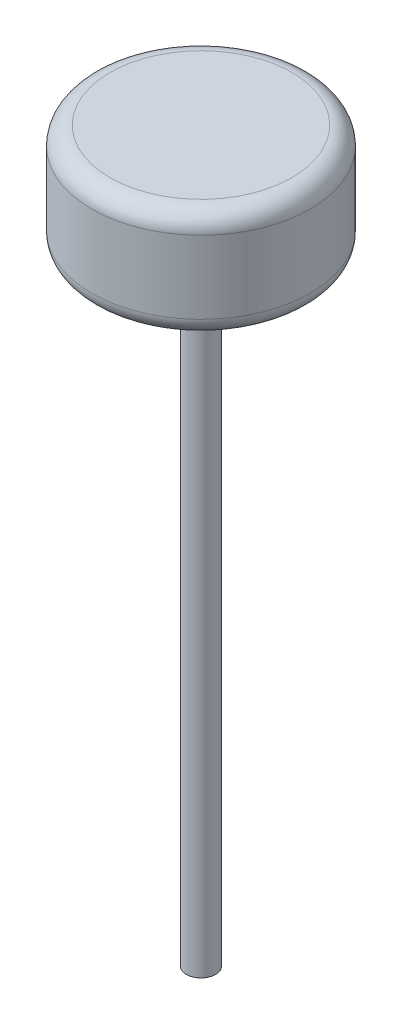
ISO-10303-21;
HEADER;
FILE_DESCRIPTION(('STEP AP214'),'2;1');
FILE_NAME('part.step','',(''),(''),'','','');
FILE_SCHEMA(('AUTOMOTIVE_DESIGN { 1 0 10303 214 1 1 1 1 }'));
ENDSEC;
DATA;
#1=APPLICATION_CONTEXT('core data for automotive mechanical design processes');
#2=APPLICATION_PROTOCOL_DEFINITION('international standard','automotive_design',2000,#1);
#3=PRODUCT_CONTEXT('',#1,'mechanical');
#4=PRODUCT('Part','Part','',(#3));
#5=PRODUCT_RELATED_PRODUCT_CATEGORY('part','',(#4));
#6=PRODUCT_DEFINITION_FORMATION('','',#4);
#7=PRODUCT_DEFINITION_CONTEXT('part definition',#1,'design');
#8=PRODUCT_DEFINITION('design','',#6,#7);
#9=PRODUCT_DEFINITION_SHAPE('','',#8);
#10=(LENGTH_UNIT() NAMED_UNIT(*) SI_UNIT(.MILLI.,.METRE.));
#11=(NAMED_UNIT(*) PLANE_ANGLE_UNIT() SI_UNIT($,.RADIAN.));
#12=(NAMED_UNIT(*) SI_UNIT($,.STERADIAN.) SOLID_ANGLE_UNIT());
#13=UNCERTAINTY_MEASURE_WITH_UNIT(LENGTH_MEASURE(1.E-05),#10,'distance_accuracy_value','');
#14=(GEOMETRIC_REPRESENTATION_CONTEXT(3) GLOBAL_UNCERTAINTY_ASSIGNED_CONTEXT((#13)) GLOBAL_UNIT_ASSIGNED_CONTEXT((#10,
#11,#12)) REPRESENTATION_CONTEXT('',''));
#15=CARTESIAN_POINT('',(0.,0.,0.));
#16=DIRECTION('',(0.,0.,1.));
#17=DIRECTION('',(1.,0.,0.));
#18=AXIS2_PLACEMENT_3D('',#15,#16,#17);
#19=CARTESIAN_POINT('',(0.,170.,0.));
#20=DIRECTION('',(0.,-1.,0.));
#21=DIRECTION('',(0.,0.,-1.));
#22=AXIS2_PLACEMENT_3D('',#19,#20,#21);
#23=CYLINDRICAL_SURFACE('',#22,4.);
#24=CARTESIAN_POINT('',(0.,170.,0.));
#25=DIRECTION('',(0.,1.,0.));
#26=DIRECTION('',(0.,0.,1.));
#27=AXIS2_PLACEMENT_3D('',#24,#25,#26);
#28=CIRCLE('',#27,4.);
#29=CARTESIAN_POINT('',(0.,170.,4.));
#30=VERTEX_POINT('',#29);
#31=EDGE_CURVE('E51',#30,#30,#28,.T.);
#32=ORIENTED_EDGE('',*,*,#31,.F.);
#33=EDGE_LOOP('',(#32));
#34=FACE_BOUND('',#33,.T.);
#35=CARTESIAN_POINT('',(0.,0.,0.));
#36=DIRECTION('',(0.,1.,0.));
#37=DIRECTION('',(0.,0.,1.));
#38=AXIS2_PLACEMENT_3D('',#35,#36,#37);
#39=CIRCLE('',#38,4.);
#40=CARTESIAN_POINT('',(0.,0.,4.));
#41=VERTEX_POINT('',#40);
#42=EDGE_CURVE('E52',#41,#41,#39,.T.);
#43=ORIENTED_EDGE('',*,*,#42,.T.);
#44=EDGE_LOOP('',(#43));
#45=FACE_BOUND('',#44,.T.);
#46=ADVANCED_FACE('F31',(#34,#45),#23,.T.);
#47=CARTESIAN_POINT('',(0.,0.,0.));
#48=DIRECTION('',(0.,1.,0.));
#49=DIRECTION('',(0.,0.,1.));
#50=AXIS2_PLACEMENT_3D('',#47,#48,#49);
#51=PLANE('',#50);
#52=ORIENTED_EDGE('',*,*,#42,.F.);
#53=EDGE_LOOP('',(#52));
#54=FACE_BOUND('',#53,.T.);
#55=ADVANCED_FACE('F62',(#54),#51,.F.);
#56=CARTESIAN_POINT('',(0.,170.,0.));
#57=DIRECTION('',(0.,1.,0.));
#58=DIRECTION('',(0.,0.,1.));
#59=AXIS2_PLACEMENT_3D('',#56,#57,#58);
#60=PLANE('',#59);
#61=CARTESIAN_POINT('',(0.,170.,0.));
#62=DIRECTION('',(0.,1.,0.));
#63=DIRECTION('',(0.,0.,1.));
#64=AXIS2_PLACEMENT_3D('',#61,#62,#63);
#65=CIRCLE('',#64,25.);
#66=CARTESIAN_POINT('',(0.,170.,25.));
#67=VERTEX_POINT('',#66);
#68=EDGE_CURVE('E38',#67,#67,#65,.F.);
#69=ORIENTED_EDGE('',*,*,#68,.T.);
#70=EDGE_LOOP('',(#69));
#71=FACE_BOUND('',#70,.T.);
#72=ORIENTED_EDGE('',*,*,#31,.T.);
#73=EDGE_LOOP('',(#72));
#74=FACE_BOUND('',#73,.T.);
#75=ADVANCED_FACE('F58',(#71,#74),#60,.F.);
#76=CARTESIAN_POINT('',(0.,200.,0.));
#77=DIRECTION('',(0.,-1.,0.));
#78=DIRECTION('',(0.,0.,-1.));
#79=AXIS2_PLACEMENT_3D('',#76,#77,#78);
#80=CYLINDRICAL_SURFACE('',#79,30.);
#81=CARTESIAN_POINT('',(0.,175.,0.));
#82=DIRECTION('',(0.,1.,0.));
#83=DIRECTION('',(0.,0.,1.));
#84=AXIS2_PLACEMENT_3D('',#81,#82,#83);
#85=CIRCLE('',#84,30.);
#86=CARTESIAN_POINT('',(0.,175.,30.));
#87=VERTEX_POINT('',#86);
#88=EDGE_CURVE('E42',#87,#87,#85,.T.);
#89=ORIENTED_EDGE('',*,*,#88,.T.);
#90=EDGE_LOOP('',(#89));
#91=FACE_BOUND('',#90,.T.);
#92=CARTESIAN_POINT('',(0.,195.,0.));
#93=DIRECTION('',(0.,1.,0.));
#94=DIRECTION('',(0.,0.,1.));
#95=AXIS2_PLACEMENT_3D('',#92,#93,#94);
#96=CIRCLE('',#95,30.);
#97=CARTESIAN_POINT('',(0.,195.,30.));
#98=VERTEX_POINT('',#97);
#99=EDGE_CURVE('E46',#98,#98,#96,.F.);
#100=ORIENTED_EDGE('',*,*,#99,.T.);
#101=EDGE_LOOP('',(#100));
#102=FACE_BOUND('',#101,.T.);
#103=ADVANCED_FACE('F71',(#91,#102),#80,.T.);
#104=CARTESIAN_POINT('',(0.,200.,0.));
#105=DIRECTION('',(0.,1.,0.));
#106=DIRECTION('',(0.,0.,1.));
#107=AXIS2_PLACEMENT_3D('',#104,#105,#106);
#108=PLANE('',#107);
#109=CARTESIAN_POINT('',(0.,200.,0.));
#110=DIRECTION('',(0.,1.,0.));
#111=DIRECTION('',(0.,0.,1.));
#112=AXIS2_PLACEMENT_3D('',#109,#110,#111);
#113=CIRCLE('',#112,25.);
#114=CARTESIAN_POINT('',(0.,200.,25.));
#115=VERTEX_POINT('',#114);
#116=EDGE_CURVE('E10',#115,#115,#113,.T.);
#117=ORIENTED_EDGE('',*,*,#116,.T.);
#118=EDGE_LOOP('',(#117));
#119=FACE_BOUND('',#118,.T.);
#120=ADVANCED_FACE('F76',(#119),#108,.T.);
#121=CARTESIAN_POINT('',(0.,175.,0.));
#122=DIRECTION('',(0.,1.,0.));
#123=DIRECTION('',(0.,0.,1.));
#124=AXIS2_PLACEMENT_3D('',#121,#122,#123);
#125=TOROIDAL_SURFACE('',#124,25.,5.);
#126=ORIENTED_EDGE('',*,*,#68,.F.);
#127=EDGE_LOOP('',(#126));
#128=FACE_BOUND('',#127,.T.);
#129=ORIENTED_EDGE('',*,*,#88,.F.);
#130=EDGE_LOOP('',(#129));
#131=FACE_BOUND('',#130,.T.);
#132=ADVANCED_FACE('F74',(#128,#131),#125,.T.);
#133=CARTESIAN_POINT('',(0.,195.,0.));
#134=DIRECTION('',(0.,1.,0.));
#135=DIRECTION('',(0.,0.,1.));
#136=AXIS2_PLACEMENT_3D('',#133,#134,#135);
#137=TOROIDAL_SURFACE('',#136,25.,5.);
#138=ORIENTED_EDGE('',*,*,#99,.F.);
#139=EDGE_LOOP('',(#138));
#140=FACE_BOUND('',#139,.T.);
#141=ORIENTED_EDGE('',*,*,#116,.F.);
#142=EDGE_LOOP('',(#141));
#143=FACE_BOUND('',#142,.T.);
#144=ADVANCED_FACE('F33',(#140,#143),#137,.T.);
#145=CLOSED_SHELL('',(#46,#55,#75,#103,#120,#132,#144));
#146=MANIFOLD_SOLID_BREP('B2',#145);
#147=ADVANCED_BREP_SHAPE_REPRESENTATION('',(#18,#146),#14);
#148=SHAPE_DEFINITION_REPRESENTATION(#9,#147);
ENDSEC;
END-ISO-10303-21;
